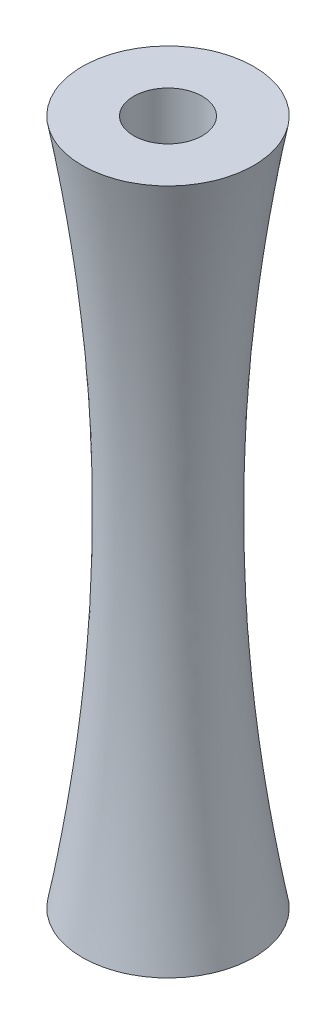
ISO-10303-21;
HEADER;
FILE_DESCRIPTION(('STEP AP214'),'2;1');
FILE_NAME('part.step','',(''),(''),'','','');
FILE_SCHEMA(('AUTOMOTIVE_DESIGN { 1 0 10303 214 1 1 1 1 }'));
ENDSEC;
DATA;
#1=APPLICATION_CONTEXT('core data for automotive mechanical design processes');
#2=APPLICATION_PROTOCOL_DEFINITION('international standard','automotive_design',2000,#1);
#3=PRODUCT_CONTEXT('',#1,'mechanical');
#4=PRODUCT('Part','Part','',(#3));
#5=PRODUCT_RELATED_PRODUCT_CATEGORY('part','',(#4));
#6=PRODUCT_DEFINITION_FORMATION('','',#4);
#7=PRODUCT_DEFINITION_CONTEXT('part definition',#1,'design');
#8=PRODUCT_DEFINITION('design','',#6,#7);
#9=PRODUCT_DEFINITION_SHAPE('','',#8);
#10=(LENGTH_UNIT() NAMED_UNIT(*) SI_UNIT(.MILLI.,.METRE.));
#11=(NAMED_UNIT(*) PLANE_ANGLE_UNIT() SI_UNIT($,.RADIAN.));
#12=(NAMED_UNIT(*) SI_UNIT($,.STERADIAN.) SOLID_ANGLE_UNIT());
#13=UNCERTAINTY_MEASURE_WITH_UNIT(LENGTH_MEASURE(1.E-05),#10,'distance_accuracy_value','');
#14=(GEOMETRIC_REPRESENTATION_CONTEXT(3) GLOBAL_UNCERTAINTY_ASSIGNED_CONTEXT((#13)) GLOBAL_UNIT_ASSIGNED_CONTEXT((#10,
#11,#12)) REPRESENTATION_CONTEXT('',''));
#15=CARTESIAN_POINT('',(0.,0.,0.));
#16=DIRECTION('',(0.,0.,1.));
#17=DIRECTION('',(1.,0.,0.));
#18=AXIS2_PLACEMENT_3D('',#15,#16,#17);
#19=CARTESIAN_POINT('',(0.,60.,0.));
#20=DIRECTION('',(0.,1.,0.));
#21=DIRECTION('',(0.,0.,1.));
#22=AXIS2_PLACEMENT_3D('',#19,#20,#21);
#23=PLANE('',#22);
#24=CARTESIAN_POINT('',(0.,60.,0.));
#25=DIRECTION('',(0.,1.,0.));
#26=DIRECTION('',(0.,0.,1.));
#27=AXIS2_PLACEMENT_3D('',#24,#25,#26);
#28=CIRCLE('',#27,3.);
#29=CARTESIAN_POINT('',(0.,60.,3.));
#30=VERTEX_POINT('',#29);
#31=EDGE_CURVE('E100',#30,#30,#28,.T.);
#32=ORIENTED_EDGE('',*,*,#31,.F.);
#33=EDGE_LOOP('',(#32));
#34=FACE_BOUND('',#33,.T.);
#35=CARTESIAN_POINT('',(0.,60.,0.));
#36=DIRECTION('',(0.,1.,0.));
#37=DIRECTION('',(0.,0.,1.));
#38=AXIS2_PLACEMENT_3D('',#35,#36,#37);
#39=CIRCLE('',#38,7.5);
#40=CARTESIAN_POINT('',(0.,60.,7.5));
#41=VERTEX_POINT('',#40);
#42=EDGE_CURVE('E11',#41,#41,#39,.T.);
#43=ORIENTED_EDGE('',*,*,#42,.T.);
#44=EDGE_LOOP('',(#43));
#45=FACE_BOUND('',#44,.T.);
#46=ADVANCED_FACE('F87',(#34,#45),#23,.T.);
#47=CARTESIAN_POINT('',(0.,0.,0.));
#48=DIRECTION('',(0.,1.,0.));
#49=DIRECTION('',(0.,0.,1.));
#50=AXIS2_PLACEMENT_3D('',#47,#48,#49);
#51=PLANE('',#50);
#52=CARTESIAN_POINT('',(0.,0.,0.));
#53=DIRECTION('',(0.,-1.,0.));
#54=DIRECTION('',(0.,0.,-1.));
#55=AXIS2_PLACEMENT_3D('',#52,#53,#54);
#56=CIRCLE('',#55,3.);
#57=CARTESIAN_POINT('',(0.,0.,-3.));
#58=VERTEX_POINT('',#57);
#59=EDGE_CURVE('E163',#58,#58,#56,.T.);
#60=ORIENTED_EDGE('',*,*,#59,.F.);
#61=EDGE_LOOP('',(#60));
#62=FACE_BOUND('',#61,.T.);
#63=CARTESIAN_POINT('',(0.,0.,0.));
#64=DIRECTION('',(0.,1.,0.));
#65=DIRECTION('',(0.,0.,1.));
#66=AXIS2_PLACEMENT_3D('',#63,#64,#65);
#67=CIRCLE('',#66,7.5);
#68=CARTESIAN_POINT('',(0.,0.,7.5));
#69=VERTEX_POINT('',#68);
#70=EDGE_CURVE('E95',#69,#69,#67,.T.);
#71=ORIENTED_EDGE('',*,*,#70,.F.);
#72=EDGE_LOOP('',(#71));
#73=FACE_BOUND('',#72,.T.);
#74=ADVANCED_FACE('F119',(#62,#73),#51,.F.);
#75=CARTESIAN_POINT('',(0.,0.,7.5));
#76=CARTESIAN_POINT('',(0.,6.64072632944228,6.25162127107653));
#77=CARTESIAN_POINT('',(0.,19.9017616439387,4.58708576383651));
#78=CARTESIAN_POINT('',(0.,40.0982383560613,4.5870857638365));
#79=CARTESIAN_POINT('',(0.,53.3592736705577,6.25162127107652));
#80=CARTESIAN_POINT('',(0.,60.,7.5));
#81=CARTESIAN_POINT('',(0.981747644821663,0.,7.5));
#82=CARTESIAN_POINT('',(0.818357373551676,6.64072632944228,6.25162127107653));
#83=CARTESIAN_POINT('',(0.600440791098656,19.9017616439387,4.58708576383651));
#84=CARTESIAN_POINT('',(0.600440791098657,40.0982383560613,4.58708576383651));
#85=CARTESIAN_POINT('',(0.818357373551675,53.3592736705577,6.25162127107652));
#86=CARTESIAN_POINT('',(0.981747644821663,60.,7.5));
#87=CARTESIAN_POINT('',(2.94482192138882,0.,7.10994749537243));
#88=CARTESIAN_POINT('',(2.45465110757885,6.64072383996429,5.92649931678231));
#89=CARTESIAN_POINT('',(1.80110525290804,19.9017631268565,4.34853905308531));
#90=CARTESIAN_POINT('',(1.80110525290804,40.0982368731434,4.34853905308531));
#91=CARTESIAN_POINT('',(2.45465110757885,53.3592761600357,5.92649931678231));
#92=CARTESIAN_POINT('',(2.94482192138882,60.,7.10994749537243));
#93=CARTESIAN_POINT('',(5.44166129928465,0.,5.44146013449238));
#94=CARTESIAN_POINT('',(4.53586462026115,6.64072384623036,4.53572733587199));
#95=CARTESIAN_POINT('',(3.32810591228955,19.901763123124,3.32806116946585));
#96=CARTESIAN_POINT('',(3.32810591228955,40.0982368768761,3.32806116946585));
#97=CARTESIAN_POINT('',(4.53586462026114,53.3592761537697,4.53572733587198));
#98=CARTESIAN_POINT('',(5.44166129928465,60.0000000000001,5.44146013449238));
#99=CARTESIAN_POINT('',(7.10969915199535,0.,2.94496975546454));
#100=CARTESIAN_POINT('',(5.926286241772,6.64072493633441,2.45480405711622));
#101=CARTESIAN_POINT('',(4.34837515630249,19.9017624737771,1.80123771160252));
#102=CARTESIAN_POINT('',(4.34837515630248,40.0982375262228,1.80123771160252));
#103=CARTESIAN_POINT('',(5.926286241772,53.3592750636655,2.45480405711622));
#104=CARTESIAN_POINT('',(7.10969915199535,59.9999999999999,2.94496975546454));
#105=CARTESIAN_POINT('',(7.69554063634128,0.,-2.67619228474895E-05));
#106=CARTESIAN_POINT('',(6.41461225339653,6.64072424410573,-2.73075102060959E-05));
#107=CARTESIAN_POINT('',(4.70667553411878,19.9017628861199,-2.80338664006645E-05));
#108=CARTESIAN_POINT('',(4.70667553411877,40.0982371138801,-2.80338664001364E-05));
#109=CARTESIAN_POINT('',(6.41461225339653,53.3592757558943,-2.73075102069825E-05));
#110=CARTESIAN_POINT('',(7.69554063634127,60.,-2.67619228474895E-05));
#111=CARTESIAN_POINT('',(7.10971578776931,0.,-2.94490446267548));
#112=CARTESIAN_POINT('',(5.92630181071778,6.64072493870547,-2.45473821202761));
#113=CARTESIAN_POINT('',(4.34838747738739,19.9017624723648,-1.80117113452925));
#114=CARTESIAN_POINT('',(4.34838747738739,40.0982375276353,-1.80117113452925));
#115=CARTESIAN_POINT('',(5.92630181071778,53.3592750612946,-2.4547382120276));
#116=CARTESIAN_POINT('',(7.10971578776931,60.0000000000001,-2.94490446267548));
#117=CARTESIAN_POINT('',(5.44161746602329,0.,-5.44157367593528));
#118=CARTESIAN_POINT('',(4.53582471749693,6.64072371496753,-4.53583514124079));
#119=CARTESIAN_POINT('',(3.32807853314484,19.9017632013138,-3.32816130333773));
#120=CARTESIAN_POINT('',(3.32807853314484,40.0982367986861,-3.32816130333773));
#121=CARTESIAN_POINT('',(4.53582471749693,53.3592762850324,-4.53583514124079));
#122=CARTESIAN_POINT('',(5.44161746602329,59.9999999999999,-5.44157367593528));
#123=CARTESIAN_POINT('',(2.94491624384262,0.,-7.10972919973185));
#124=CARTESIAN_POINT('',(2.45473844623964,6.64072442991887,-5.92629913830792));
#125=CARTESIAN_POINT('',(1.80115598155029,19.9017627754358,-4.34836312779551));
#126=CARTESIAN_POINT('',(1.80115598155029,40.0982372245642,-4.34836312779551));
#127=CARTESIAN_POINT('',(2.45473844623964,53.3592755700813,-5.92629913830792));
#128=CARTESIAN_POINT('',(2.94491624384262,60.0000000000002,-7.10972919973185));
#129=CARTESIAN_POINT('',(0.,0.,-7.69551250799886));
#130=CARTESIAN_POINT('',(0.,6.64072592199922,-6.41462674512618));
#131=CARTESIAN_POINT('',(0.,19.901761886642,-4.7067476625407));
#132=CARTESIAN_POINT('',(0.,40.0982381133578,-4.7067476625407));
#133=CARTESIAN_POINT('',(0.,53.3592740780006,-6.41462674512618));
#134=CARTESIAN_POINT('',(0.,59.9999999999999,-7.69551250799886));
#135=CARTESIAN_POINT('',(-2.94491624384264,0.,-7.10972919973187));
#136=CARTESIAN_POINT('',(-2.45473844623965,6.64072442991889,-5.92629913830794));
#137=CARTESIAN_POINT('',(-1.80115598155027,19.9017627754359,-4.34836312779553));
#138=CARTESIAN_POINT('',(-1.80115598155028,40.0982372245645,-4.34836312779554));
#139=CARTESIAN_POINT('',(-2.45473844623965,53.3592755700813,-5.92629913830793));
#140=CARTESIAN_POINT('',(-2.94491624384264,60.0000000000001,-7.10972919973187));
#141=CARTESIAN_POINT('',(-5.4416174660233,0.,-5.44157367593527));
#142=CARTESIAN_POINT('',(-4.53582471749692,6.6407237149675,-4.53583514124079));
#143=CARTESIAN_POINT('',(-3.32807853314482,19.9017632013138,-3.32816130333774));
#144=CARTESIAN_POINT('',(-3.32807853314481,40.0982367986859,-3.32816130333774));
#145=CARTESIAN_POINT('',(-4.53582471749693,53.3592762850324,-4.53583514124079));
#146=CARTESIAN_POINT('',(-5.4416174660233,59.9999999999999,-5.44157367593527));
#147=CARTESIAN_POINT('',(-7.1097157877693,0.,-2.94490446267547));
#148=CARTESIAN_POINT('',(-5.92630181071777,6.64072493870549,-2.45473821202761));
#149=CARTESIAN_POINT('',(-4.34838747738738,19.9017624723648,-1.80117113452928));
#150=CARTESIAN_POINT('',(-4.34838747738738,40.0982375276355,-1.80117113452928));
#151=CARTESIAN_POINT('',(-5.92630181071776,53.3592750612946,-2.45473821202761));
#152=CARTESIAN_POINT('',(-7.10971578776929,60.0000000000001,-2.94490446267547));
#153=CARTESIAN_POINT('',(-7.69554063634129,0.,-2.67619228362138E-05));
#154=CARTESIAN_POINT('',(-6.41461225339654,6.6407242441057,-2.73075102087398E-05));
#155=CARTESIAN_POINT('',(-4.70667553411878,19.9017628861198,-2.80338664210188E-05));
#156=CARTESIAN_POINT('',(-4.70667553411878,40.0982371138799,-2.80338664209986E-05));
#157=CARTESIAN_POINT('',(-6.41461225339654,53.3592757558941,-2.73075102087736E-05));
#158=CARTESIAN_POINT('',(-7.69554063634128,59.9999999999998,-2.67619228362138E-05));
#159=CARTESIAN_POINT('',(-7.10969915199534,0.,2.94496975546455));
#160=CARTESIAN_POINT('',(-5.92628624177201,6.64072493633445,2.45480405711621));
#161=CARTESIAN_POINT('',(-4.34837515630249,19.9017624737772,1.8012377116025));
#162=CARTESIAN_POINT('',(-4.3483751563025,40.098237526223,1.80123771160251));
#163=CARTESIAN_POINT('',(-5.926286241772,53.3592750636658,2.45480405711621));
#164=CARTESIAN_POINT('',(-7.10969915199534,60.0000000000001,2.94496975546455));
#165=CARTESIAN_POINT('',(-5.44166129928467,0.,5.44146013449239));
#166=CARTESIAN_POINT('',(-4.53586462026115,6.64072384623035,4.53572733587199));
#167=CARTESIAN_POINT('',(-3.32810591228956,19.901763123124,3.32806116946584));
#168=CARTESIAN_POINT('',(-3.32810591228955,40.0982368768761,3.32806116946584));
#169=CARTESIAN_POINT('',(-4.53586462026115,53.3592761537696,4.53572733587199));
#170=CARTESIAN_POINT('',(-5.44166129928467,59.9999999999999,5.44146013449239));
#171=CARTESIAN_POINT('',(-2.94482192138881,0.,7.10994749537242));
#172=CARTESIAN_POINT('',(-2.45465110757886,6.64072383996429,5.9264993167823));
#173=CARTESIAN_POINT('',(-1.80110525290805,19.9017631268565,4.34853905308532));
#174=CARTESIAN_POINT('',(-1.80110525290805,40.0982368731434,4.34853905308532));
#175=CARTESIAN_POINT('',(-2.45465110757885,53.3592761600358,5.9264993167823));
#176=CARTESIAN_POINT('',(-2.94482192138881,60.,7.10994749537242));
#177=CARTESIAN_POINT('',(-0.981747644821663,0.,7.5));
#178=CARTESIAN_POINT('',(-0.818357373551675,6.64072632944228,6.25162127107653));
#179=CARTESIAN_POINT('',(-0.600440791098657,19.9017616439387,4.58708576383651));
#180=CARTESIAN_POINT('',(-0.600440791098656,40.0982383560612,4.5870857638365));
#181=CARTESIAN_POINT('',(-0.818357373551675,53.3592736705577,6.25162127107652));
#182=CARTESIAN_POINT('',(-0.981747644821663,60.,7.5));
#183=CARTESIAN_POINT('',(0.,0.,7.5));
#184=CARTESIAN_POINT('',(0.,6.64072632944228,6.25162127107653));
#185=CARTESIAN_POINT('',(0.,19.9017616439387,4.58708576383651));
#186=CARTESIAN_POINT('',(0.,40.0982383560613,4.5870857638365));
#187=CARTESIAN_POINT('',(0.,53.3592736705577,6.25162127107652));
#188=CARTESIAN_POINT('',(0.,60.,7.5));
#189=B_SPLINE_SURFACE_WITH_KNOTS('',3,3,((#75,#76,#77,#78,#79,#80),(#81,#82,#83,#84,#85,#86),
(#87,#88,#89,#90,#91,#92),(#93,#94,#95,#96,#97,#98),(#99,#100,#101,#102,#103,#104),(#105,#106,
#107,#108,#109,#110),(#111,#112,#113,#114,#115,#116),(#117,#118,#119,#120,#121,#122),(#123,#124,
#125,#126,#127,#128),(#129,#130,#131,#132,#133,#134),(#135,#136,#137,#138,#139,#140),(#141,#142,
#143,#144,#145,#146),(#147,#148,#149,#150,#151,#152),(#153,#154,#155,#156,#157,#158),(#159,#160,
#161,#162,#163,#164),(#165,#166,#167,#168,#169,#170),(#171,#172,#173,#174,#175,#176),(#177,#178,
#179,#180,#181,#182),(#183,#184,#185,#186,#187,#188)),.UNSPECIFIED.,.T.,.F.,.F.,(4,1,1,1,1,1,1,
1,1,1,1,1,1,1,1,1,4),(4,1,1,4),(0.,0.0625,0.125,0.1875,0.25,0.3125,0.375,0.4375,0.5,0.5625,
0.625,0.6875,0.75,0.8125,0.875,0.9375,1.),(0.,0.334193561293937,0.665806438706063,1.),.UNSPECIFIED.);
#190=CARTESIAN_POINT('',(0.,0.,7.5));
#191=CARTESIAN_POINT('',(0.,0.0776125402742504,7.48540975171107));
#192=CARTESIAN_POINT('',(0.,0.155235393256961,7.47087436076974));
#193=CARTESIAN_POINT('',(0.,0.310485436550854,7.44191644167547));
#194=CARTESIAN_POINT('',(0.,0.388112622599399,7.4274938906695));
#195=CARTESIAN_POINT('',(0.,0.543371432193753,7.39876167207162));
#196=CARTESIAN_POINT('',(0.,0.621003051571173,7.38445198195527));
#197=CARTESIAN_POINT('',(0.,0.776270827807163,7.35594550543869));
#198=CARTESIAN_POINT('',(0.,0.853906980590911,7.34174869684396));
#199=CARTESIAN_POINT('',(0.,1.00918392367389,7.31346800375774));
#200=CARTESIAN_POINT('',(0.,1.08682470999112,7.29938409740292));
#201=CARTESIAN_POINT('',(0.,1.24211102016281,7.2713292291593));
#202=CARTESIAN_POINT('',(0.,1.31975654012736,7.25735824573959));
#203=CARTESIAN_POINT('',(0.,1.47505241761974,7.22952924373386));
#204=CARTESIAN_POINT('',(0.,1.55270277134901,7.21567120395062));
#205=CARTESIAN_POINT('',(0.,1.70800841639666,7.18806810958264));
#206=CARTESIAN_POINT('',(0.,1.78566370400708,7.17432303413557));
#207=CARTESIAN_POINT('',(0.,1.94097931684388,7.14694588880395));
#208=CARTESIAN_POINT('',(0.,2.01863963845214,7.1333137983932));
#209=CARTESIAN_POINT('',(0.,2.17396541931215,7.10616264349688));
#210=CARTESIAN_POINT('',(0.,2.25163087503485,7.09264355882246));
#211=CARTESIAN_POINT('',(0.,2.40696702415208,7.06571843576029));
#212=CARTESIAN_POINT('',(0.,2.48463771410585,7.05231237752224));
#213=CARTESIAN_POINT('',(0.,2.63998443171431,7.0256133276931));
#214=CARTESIAN_POINT('',(0.,2.71766045601575,7.01232031659145));
#215=CARTESIAN_POINT('',(0.,2.87301794234945,6.9858473813942));
#216=CARTESIAN_POINT('',(0.,2.95069940111518,6.97266743812897));
#217=CARTESIAN_POINT('',(0.,3.10606785640812,6.94642065896248));
#218=CARTESIAN_POINT('',(0.,3.18375484975473,6.93335380423368));
#219=CARTESIAN_POINT('',(0.,3.3391344742409,6.90733322249681));
#220=CARTESIAN_POINT('',(0.,3.416827102285,6.89437947700444));
#221=CARTESIAN_POINT('',(0.,3.5722180961984,6.86858513409604));
#222=CARTESIAN_POINT('',(0.,3.64991645905656,6.85574451854012));
#223=CARTESIAN_POINT('',(0.,3.80531902263119,6.83017645585905));
#224=CARTESIAN_POINT('',(0.,3.88302322041999,6.81744899093956));
#225=CARTESIAN_POINT('',(0.,4.03843755388983,6.79210724988467));
#226=CARTESIAN_POINT('',(0.,4.11614768672586,6.7794929563016));
#227=CARTESIAN_POINT('',(0.,4.27157399032488,6.75437757827174));
#228=CARTESIAN_POINT('',(0.,4.3492901583247,6.74187647672507));
#229=CARTESIAN_POINT('',(0.,4.50472863228689,6.71698750311907));
#230=CARTESIAN_POINT('',(0.,4.58245093556707,6.70459961430877));
#231=CARTESIAN_POINT('',(0.,4.7379017801264,6.67993708652549));
#232=CARTESIAN_POINT('',(0.,4.81563031880349,6.66766243115153));
#233=CARTESIAN_POINT('',(0.,4.97109373419392,6.6432263905898));
#234=CARTESIAN_POINT('',(0.,5.04882860838449,6.63106498935213));
#235=CARTESIAN_POINT('',(0.,5.20430479483998,6.60685547741078));
#236=CARTESIAN_POINT('',(0.,5.28204610466057,6.59480735100936));
#237=CARTESIAN_POINT('',(0.,5.43753526241508,6.57082440908723));
#238=CARTESIAN_POINT('',(0.,5.51528310798223,6.558889578222));
#239=CARTESIAN_POINT('',(0.,5.67078543726973,6.53513324771792));
#240=CARTESIAN_POINT('',(0.,5.74853991869998,6.5233117330888));
#241=CARTESIAN_POINT('',(0.,5.9040556197544,6.49978205540159));
#242=CARTESIAN_POINT('',(0.,5.98181683716428,6.48807387770853));
#243=CARTESIAN_POINT('',(0.,6.13734611021958,6.46477089423701));
#244=CARTESIAN_POINT('',(0.,6.21511416372562,6.45317607417993));
#245=CARTESIAN_POINT('',(0.,6.37065720901573,6.43009982632292));
#246=CARTESIAN_POINT('',(0.,6.44843219873445,6.41861838460172));
#247=CARTESIAN_POINT('',(0.,6.60398921649332,6.39576891375804));
#248=CARTESIAN_POINT('',(0.,6.68177124254123,6.38440087107262));
#249=CARTESIAN_POINT('',(0.,6.83734243300279,6.36177821864109));
#250=CARTESIAN_POINT('',(0.,6.9151315954964,6.35052359569135));
#251=CARTESIAN_POINT('',(0.,7.07071715889458,6.32812780307076));
#252=CARTESIAN_POINT('',(0.,7.14851355795041,6.31698662055661));
#253=CARTESIAN_POINT('',(0.,7.30411369451913,6.29481772914577));
#254=CARTESIAN_POINT('',(0.,7.38191743025366,6.28379000776707));
#255=CARTESIAN_POINT('',(0.,7.53753234022685,6.26184805896479));
#256=CARTESIAN_POINT('',(0.,7.61534351275659,6.25093381942142));
#257=CARTESIAN_POINT('',(0.,7.77097339636817,6.22921885462649));
#258=CARTESIAN_POINT('',(0.,7.8487921058096,6.21841811761831));
#259=CARTESIAN_POINT('',(0.,8.00443716329347,6.19693017822953));
#260=CARTESIAN_POINT('',(0.,8.08226350976309,6.1862429644564));
#261=CARTESIAN_POINT('',(0.,8.23792394135317,6.16498209187255));
#262=CARTESIAN_POINT('',(0.,8.31575802496745,6.15440842203433));
#263=CARTESIAN_POINT('',(0.,8.47143403089765,6.13337465765421));
#264=CARTESIAN_POINT('',(0.,8.54927595177306,6.12291455245072));
#265=CARTESIAN_POINT('',(0.,8.70496773227728,6.1021079376731));
#266=CARTESIAN_POINT('',(0.,8.7828175905303,6.09176141780419));
#267=CARTESIAN_POINT('',(0.,8.93852534584244,6.07118199402786));
#268=CARTESIAN_POINT('',(0.,9.01638324158953,6.06094908019335));
#269=CARTESIAN_POINT('',(0.,9.17210717194349,6.04059688881707));
#270=CARTESIAN_POINT('',(0.,9.24997320530111,6.03047760171678));
#271=CARTESIAN_POINT('',(0.,9.40571351093078,6.01035268413934));
#272=CARTESIAN_POINT('',(0.,9.48358778201539,6.00034704447306));
#273=CARTESIAN_POINT('',(0.,9.63934466315466,5.98044944209322));
#274=CARTESIAN_POINT('',(0.,9.71722727208271,5.97055747056077));
#275=CARTESIAN_POINT('',(0.,9.87300092896546,5.95088722477729));
#276=CARTESIAN_POINT('',(0.,9.9508919758534,5.94110894207845));
#277=CARTESIAN_POINT('',(0.,10.1066826087135,5.9216660942901));
#278=CARTESIAN_POINT('',(0.,10.1845821936778,5.91200152112465));
#279=CARTESIAN_POINT('',(0.,10.3403900027491,5.89278611273018));
#280=CARTESIAN_POINT('',(0.,10.4182982259062,5.88323526979789));
#281=CARTESIAN_POINT('',(0.,10.5741234114227,5.86424734219605));
#282=CARTESIAN_POINT('',(0.,10.6520403728889,5.8548102501967));
#283=CARTESIAN_POINT('',(0.,10.8078831350844,5.83604984478624));
#284=CARTESIAN_POINT('',(0.,10.8858089349763,5.82672652441957));
#285=CARTESIAN_POINT('',(0.,11.0416694740846,5.80819368259924));
#286=CARTESIAN_POINT('',(0.,11.1196042125185,5.79898415456501));
#287=CARTESIAN_POINT('',(0.,11.2754827287736,5.78067891773355));
#288=CARTESIAN_POINT('',(0.,11.353426505866,5.77158320273147));
#289=CARTESIAN_POINT('',(0.,11.5093231995017,5.75350561228762));
#290=CARTESIAN_POINT('',(0.,11.587276115369,5.74452373101745));
#291=CARTESIAN_POINT('',(0.,11.7431911866191,5.72667382835993));
#292=CARTESIAN_POINT('',(0.,11.8211533413777,5.71780580152137));
#293=CARTESIAN_POINT('',(0.,11.9770869904761,5.70018362804892));
#294=CARTESIAN_POINT('',(0.,12.0550584842425,5.6914294763417));
#295=CARTESIAN_POINT('',(0.,12.211010911423,5.67403507345303));
#296=CARTESIAN_POINT('',(0.,12.2889918443135,5.66539481757684));
#297=CARTESIAN_POINT('',(0.,12.4449632498101,5.64822822667068));
#298=CARTESIAN_POINT('',(0.,12.5229537219411,5.63970188732522));
#299=CARTESIAN_POINT('',(0.,12.6789443059875,5.62276314980029));
#300=CARTESIAN_POINT('',(0.,12.7569444174755,5.61435074768523));
#301=CARTESIAN_POINT('',(0.,12.9129543803056,5.59763990494023));
#302=CARTESIAN_POINT('',(0.,12.9909642312669,5.58934146075526));
#303=CARTESIAN_POINT('',(0.,13.1469937731145,5.57285855418891));
#304=CARTESIAN_POINT('',(0.,13.2250134636655,5.56467408863368));
#305=CARTESIAN_POINT('',(0.,13.3810627847645,5.54841915964468));
#306=CARTESIAN_POINT('',(0.,13.4590924150217,5.54034869341885));
#307=CARTESIAN_POINT('',(0.,13.6151617156059,5.5243217834059));
#308=CARTESIAN_POINT('',(0.,13.6932013856855,5.51636533720913));
#309=CARTESIAN_POINT('',(0.,13.8492908659887,5.50056648757092));
#310=CARTESIAN_POINT('',(0.,13.9273406760072,5.49272408210283));
#311=CARTESIAN_POINT('',(0.,14.0834505362634,5.47715333423805));
#312=CARTESIAN_POINT('',(0.,14.1615105863371,5.46942499019828));
#313=CARTESIAN_POINT('',(0.,14.31764102678,5.45408238550562));
#314=CARTESIAN_POINT('',(0.,14.3957114170253,5.44646812359378));
#315=CARTESIAN_POINT('',(0.,14.5518626378887,5.43135370347193));
#316=CARTESIAN_POINT('',(0.,14.629943468422,5.42385354438763));
#317=CARTESIAN_POINT('',(0.,14.7861156699398,5.40896735023526));
#318=CARTESIAN_POINT('',(0.,14.8642070408775,5.40158131467811));
#319=CARTESIAN_POINT('',(0.,15.0204004232834,5.38692338789388));
#320=CARTESIAN_POINT('',(0.,15.0985024347418,5.37965149656346));
#321=CARTESIAN_POINT('',(0.,15.2547171982697,5.36522187854605));
#322=CARTESIAN_POINT('',(0.,15.3328299503653,5.35806415214195));
#323=CARTESIAN_POINT('',(0.,15.4890662952489,5.34386288429003));
#324=CARTESIAN_POINT('',(0.,15.5671898880979,5.33681934351181));
#325=CARTESIAN_POINT('',(0.,15.7234480145713,5.32284646722404));
#326=CARTESIAN_POINT('',(0.,15.8015825482901,5.31591713277127));
#327=CARTESIAN_POINT('',(0.,15.9578626565868,5.30217268944629));
#328=CARTESIAN_POINT('',(0.,16.0360082312918,5.29535758201851));
#329=CARTESIAN_POINT('',(0.,16.1923105216457,5.28184161305499));
#330=CARTESIAN_POINT('',(0.,16.2704672374532,5.27514075335176));
#331=CARTESIAN_POINT('',(0.,16.4267919100982,5.26185330014833));
#332=CARTESIAN_POINT('',(0.,16.5049598671246,5.25526670886917));
#333=CARTESIAN_POINT('',(0.,16.6613071222945,5.24220781282447));
#334=CARTESIAN_POINT('',(0.,16.739486420656,5.23573551066891));
#335=CARTESIAN_POINT('',(0.,16.8958564585845,5.2229052131816));
#336=CARTESIAN_POINT('',(0.,16.9740471983976,5.21654722084914));
#337=CARTESIAN_POINT('',(0.,17.1304402193186,5.20394556331784));
#338=CARTESIAN_POINT('',(0.,17.2086425006996,5.19770190150799));
#339=CARTESIAN_POINT('',(0.,17.3650587048468,5.18532892533132));
#340=CARTESIAN_POINT('',(0.,17.4432726279121,5.17919961474358));
#341=CARTESIAN_POINT('',(0.,17.5997122155194,5.16705536132017));
#342=CARTESIAN_POINT('',(0.,17.6779378803851,5.16104042265402));
#343=CARTESIAN_POINT('',(0.,17.8344010516863,5.14912493338248));
#344=CARTESIAN_POINT('',(0.,17.912638558469,5.14322438733737));
#345=CARTESIAN_POINT('',(0.,18.0691255136978,5.13153770361639));
#346=CARTESIAN_POINT('',(0.,18.1473749625137,5.12575157089189));
#347=CARTESIAN_POINT('',(0.,18.3038859019039,5.11429373411977));
#348=CARTESIAN_POINT('',(0.,18.3821473928694,5.10862203541491));
#349=CARTESIAN_POINT('',(0.,18.5386825166549,5.09739308699141));
#350=CARTESIAN_POINT('',(0.,18.6169561498863,5.09183584300721));
#351=CARTESIAN_POINT('',(0.,18.7735156583006,5.08083582432665));
#352=CARTESIAN_POINT('',(0.,18.8518015339139,5.0753930557567));
#353=CARTESIAN_POINT('',(0.,19.0083856271918,5.06462200823361));
#354=CARTESIAN_POINT('',(0.,19.0866838453048,5.05929373579909));
#355=CARTESIAN_POINT('',(0.,19.2432927236764,5.04875170077263));
#356=CARTESIAN_POINT('',(0.,19.3216033844002,5.0435379450918));
#357=CARTESIAN_POINT('',(0.,19.478237248113,5.0332249641823));
#358=CARTESIAN_POINT('',(0.,19.5565604515829,5.02812574625746));
#359=CARTESIAN_POINT('',(0.,19.7132195008194,5.01804186003594));
#360=CARTESIAN_POINT('',(0.,19.7915553470814,5.01305719943593));
#361=CARTESIAN_POINT('',(0.,19.9482397763526,5.00320245276174));
#362=CARTESIAN_POINT('',(0.,20.0265883598701,4.99833237476895));
#363=CARTESIAN_POINT('',(0.,20.1832981790801,4.98870680508653));
#364=CARTESIAN_POINT('',(0.,20.2616594152766,4.98395132160103));
#365=CARTESIAN_POINT('',(0.,20.4183942493215,4.97455493556707));
#366=CARTESIAN_POINT('',(0.,20.496767847651,4.96991404104381));
#367=CARTESIAN_POINT('',(0.,20.6535271045492,4.96074683442519));
#368=CARTESIAN_POINT('',(0.,20.7319127635758,4.95622053015999));
#369=CARTESIAN_POINT('',(0.,20.8886958403522,4.94728250390532));
#370=CARTESIAN_POINT('',(0.,20.9670932585372,4.9428707895508));
#371=CARTESIAN_POINT('',(0.,21.1238995521413,4.9341619434057));
#372=CARTESIAN_POINT('',(0.,21.2023084279735,4.92986481905483));
#373=CARTESIAN_POINT('',(0.,21.359137335375,4.92138515308726));
#374=CARTESIAN_POINT('',(0.,21.4375573673359,4.91720261871501));
#375=CARTESIAN_POINT('',(0.,21.594408285499,4.9089521329066));
#376=CARTESIAN_POINT('',(0.,21.672839172072,4.90488418851956));
#377=CARTESIAN_POINT('',(0.,21.8297114979625,4.89686288287506));
#378=CARTESIAN_POINT('',(0.,21.9081529376305,4.89290952847135));
#379=CARTESIAN_POINT('',(0.,22.0650460682138,4.88511740298932));
#380=CARTESIAN_POINT('',(0.,22.1434977594598,4.88127863856934));
#381=CARTESIAN_POINT('',(0.,22.3004110917013,4.87371569324999));
#382=CARTESIAN_POINT('',(0.,22.3788727330083,4.86999151881353));
#383=CARTESIAN_POINT('',(0.,22.5358056638734,4.86265775365666));
#384=CARTESIAN_POINT('',(0.,22.6142769537244,4.85904816920368));
#385=CARTESIAN_POINT('',(0.,22.7712288801787,4.85194358420917));
#386=CARTESIAN_POINT('',(0.,22.8497095170567,4.84844858973958));
#387=CARTESIAN_POINT('',(0.,23.0066798360654,4.84157318490733));
#388=CARTESIAN_POINT('',(0.,23.0851695184535,4.83819278042106));
#389=CARTESIAN_POINT('',(0.,23.2421576269822,4.83154655575095));
#390=CARTESIAN_POINT('',(0.,23.3206560533633,4.82828074124792));
#391=CARTESIAN_POINT('',(0.,23.4776613483773,4.82186369673984));
#392=CARTESIAN_POINT('',(0.,23.5561682172344,4.81871247222));
#393=CARTESIAN_POINT('',(0.,23.7131900956993,4.81252460787384));
#394=CARTESIAN_POINT('',(0.,23.7917051055154,4.80948797333711));
#395=CARTESIAN_POINT('',(0.,23.9487429643965,4.80352928915278));
#396=CARTESIAN_POINT('',(0.,24.0272658136546,4.80060724459909));
#397=CARTESIAN_POINT('',(0.,24.1843190499173,4.79487774057649));
#398=CARTESIAN_POINT('',(0.,24.2628494371005,4.79207028600579));
#399=CARTESIAN_POINT('',(0.,24.4199174477103,4.78656996214483));
#400=CARTESIAN_POINT('',(0.,24.4984550713016,4.78387709755706));
#401=CARTESIAN_POINT('',(0.,24.6555372532239,4.77860595385764));
#402=CARTESIAN_POINT('',(0.,24.7340818117062,4.77602767925273));
#403=CARTESIAN_POINT('',(0.,24.8911775619064,4.77098571571477));
#404=CARTESIAN_POINT('',(0.,24.9697287537627,4.76852203109269));
#405=CARTESIAN_POINT('',(0.,25.1268374692063,4.7637092477161));
#406=CARTESIAN_POINT('',(0.,25.2053949929196,4.76136015307678));
#407=CARTESIAN_POINT('',(0.,25.362516070572,4.7567765498615));
#408=CARTESIAN_POINT('',(0.,25.4410796246254,4.75454204520489));
#409=CARTESIAN_POINT('',(0.,25.598212461452,4.75018762215083));
#410=CARTESIAN_POINT('',(0.,25.6767817443284,4.7480677074769));
#411=CARTESIAN_POINT('',(0.,25.8339257372947,4.74394246458399));
#412=CARTESIAN_POINT('',(0.,25.9125004474771,4.74193713989268));
#413=CARTESIAN_POINT('',(0.,26.0696549935484,4.73804107716086));
#414=CARTESIAN_POINT('',(0.,26.1482348295199,4.73615034245214));
#415=CARTESIAN_POINT('',(0.,26.3053993256617,4.73248345988134));
#416=CARTESIAN_POINT('',(0.,26.3839839859052,4.73070731515516));
#417=CARTESIAN_POINT('',(0.,26.541157829083,4.72726961274532));
#418=CARTESIAN_POINT('',(0.,26.6197470120815,4.72560805800165));
#419=CARTESIAN_POINT('',(0.,26.7769295992606,4.72239953575272));
#420=CARTESIAN_POINT('',(0.,26.8555230034971,4.72085257099151));
#421=CARTESIAN_POINT('',(0.,27.012713731643,4.71787322890344));
#422=CARTESIAN_POINT('',(0.,27.0913110556006,4.71644085412468));
#423=CARTESIAN_POINT('',(0.,27.2485093216786,4.71369069219741));
#424=CARTESIAN_POINT('',(0.,27.3271102638403,4.71237290740106));
#425=CARTESIAN_POINT('',(0.,27.4843154648159,4.70985192563456));
#426=CARTESIAN_POINT('',(0.,27.5629197236646,4.70864873082059));
#427=CARTESIAN_POINT('',(0.,27.7201312565033,4.70635692921481));
#428=CARTESIAN_POINT('',(0.,27.798738530522,4.7052683243832));
#429=CARTESIAN_POINT('',(0.,27.9559557921892,4.7032057029381));
#430=CARTESIAN_POINT('',(0.,28.0345657798608,4.70223168808882));
#431=CARTESIAN_POINT('',(0.,28.1917881673219,4.70039824680438));
#432=CARTESIAN_POINT('',(0.,28.2704005671296,4.69953882193741));
#433=CARTESIAN_POINT('',(0.,28.42762747735,4.69793456081359));
#434=CARTESIAN_POINT('',(0.,28.5062419877768,4.69718972592893));
#435=CARTESIAN_POINT('',(0.,28.6634728177219,4.69581464496569));
#436=CARTESIAN_POINT('',(0.,28.7420891372507,4.69518440006331));
#437=CARTESIAN_POINT('',(0.,28.899323283886,4.69403849926065));
#438=CARTESIAN_POINT('',(0.,28.9779411109997,4.69352284434054));
#439=CARTESIAN_POINT('',(0.,29.1351779712906,4.69260612369844));
#440=CARTESIAN_POINT('',(0.,29.2137970044724,4.69220505876058));
#441=CARTESIAN_POINT('',(0.,29.3710359753843,4.69151751827902));
#442=CARTESIAN_POINT('',(0.,29.4496559131171,4.69123104332341));
#443=CARTESIAN_POINT('',(0.,29.6068963916155,4.69077268300238));
#444=CARTESIAN_POINT('',(0.,29.6855169323822,4.69060079802902));
#445=CARTESIAN_POINT('',(0.,29.8427583154325,4.6903716178685));
#446=CARTESIAN_POINT('',(0.,29.9213791577162,4.69031432287738));
#447=CARTESIAN_POINT('',(0.,30.0786208422838,4.69031432287738));
#448=CARTESIAN_POINT('',(0.,30.1572416845675,4.6903716178685));
#449=CARTESIAN_POINT('',(0.,30.3144830676178,4.69060079802902));
#450=CARTESIAN_POINT('',(0.,30.3931036083845,4.69077268300238));
#451=CARTESIAN_POINT('',(0.,30.5503440868829,4.69123104332341));
#452=CARTESIAN_POINT('',(0.,30.6289640246157,4.69151751827902));
#453=CARTESIAN_POINT('',(0.,30.7862029955276,4.69220505876058));
#454=CARTESIAN_POINT('',(0.,30.8648220287094,4.69260612369844));
#455=CARTESIAN_POINT('',(0.,31.0220588890003,4.69352284434054));
#456=CARTESIAN_POINT('',(0.,31.100676716114,4.69403849926065));
#457=CARTESIAN_POINT('',(0.,31.2579108627493,4.69518440006331));
#458=CARTESIAN_POINT('',(0.,31.3365271822781,4.69581464496569));
#459=CARTESIAN_POINT('',(0.,31.4937580122232,4.69718972592893));
#460=CARTESIAN_POINT('',(0.,31.5723725226499,4.69793456081359));
#461=CARTESIAN_POINT('',(0.,31.7295994328704,4.69953882193741));
#462=CARTESIAN_POINT('',(0.,31.8082118326781,4.70039824680437));
#463=CARTESIAN_POINT('',(0.,31.9654342201392,4.70223168808882));
#464=CARTESIAN_POINT('',(0.,32.0440442078108,4.7032057029381));
#465=CARTESIAN_POINT('',(0.,32.201261469478,4.7052683243832));
#466=CARTESIAN_POINT('',(0.,32.2798687434967,4.70635692921481));
#467=CARTESIAN_POINT('',(0.,32.4370802763354,4.70864873082059));
#468=CARTESIAN_POINT('',(0.,32.5156845351841,4.70985192563456));
#469=CARTESIAN_POINT('',(0.,32.6728897361597,4.71237290740106));
#470=CARTESIAN_POINT('',(0.,32.7514906783213,4.71369069219741));
#471=CARTESIAN_POINT('',(0.,32.9086889443994,4.71644085412468));
#472=CARTESIAN_POINT('',(0.,32.987286268357,4.71787322890344));
#473=CARTESIAN_POINT('',(0.,33.1444769965029,4.72085257099151));
#474=CARTESIAN_POINT('',(0.,33.2230704007394,4.72239953575272));
#475=CARTESIAN_POINT('',(0.,33.3802529879185,4.72560805800165));
#476=CARTESIAN_POINT('',(0.,33.458842170917,4.72726961274532));
#477=CARTESIAN_POINT('',(0.,33.6160160140948,4.73070731515516));
#478=CARTESIAN_POINT('',(0.,33.6946006743383,4.73248345988134));
#479=CARTESIAN_POINT('',(0.,33.8517651704801,4.73615034245214));
#480=CARTESIAN_POINT('',(0.,33.9303450064516,4.73804107716086));
#481=CARTESIAN_POINT('',(0.,34.0874995525229,4.74193713989268));
#482=CARTESIAN_POINT('',(0.,34.1660742627053,4.74394246458399));
#483=CARTESIAN_POINT('',(0.,34.3232182556716,4.7480677074769));
#484=CARTESIAN_POINT('',(0.,34.401787538548,4.75018762215083));
#485=CARTESIAN_POINT('',(0.,34.5589203753746,4.75454204520489));
#486=CARTESIAN_POINT('',(0.,34.637483929428,4.7567765498615));
#487=CARTESIAN_POINT('',(0.,34.7946050070804,4.76136015307678));
#488=CARTESIAN_POINT('',(0.,34.8731625307937,4.7637092477161));
#489=CARTESIAN_POINT('',(0.,35.0302712462373,4.76852203109269));
#490=CARTESIAN_POINT('',(0.,35.1088224380936,4.77098571571477));
#491=CARTESIAN_POINT('',(0.,35.2659181882938,4.77602767925273));
#492=CARTESIAN_POINT('',(0.,35.3444627467761,4.77860595385763));
#493=CARTESIAN_POINT('',(0.,35.5015449286984,4.78387709755705));
#494=CARTESIAN_POINT('',(0.,35.5800825522897,4.78656996214483));
#495=CARTESIAN_POINT('',(0.,35.7371505628995,4.79207028600579));
#496=CARTESIAN_POINT('',(0.,35.8156809500827,4.79487774057649));
#497=CARTESIAN_POINT('',(0.,35.9727341863454,4.80060724459909));
#498=CARTESIAN_POINT('',(0.,36.0512570356035,4.80352928915278));
#499=CARTESIAN_POINT('',(0.,36.2082948944846,4.80948797333711));
#500=CARTESIAN_POINT('',(0.,36.2868099043007,4.81252460787384));
#501=CARTESIAN_POINT('',(0.,36.4438317827656,4.81871247222));
#502=CARTESIAN_POINT('',(0.,36.5223386516227,4.82186369673984));
#503=CARTESIAN_POINT('',(0.,36.6793439466367,4.82828074124792));
#504=CARTESIAN_POINT('',(0.,36.7578423730178,4.83154655575095));
#505=CARTESIAN_POINT('',(0.,36.9148304815465,4.83819278042106));
#506=CARTESIAN_POINT('',(0.,36.9933201639346,4.84157318490733));
#507=CARTESIAN_POINT('',(0.,37.1502904829433,4.84844858973958));
#508=CARTESIAN_POINT('',(0.,37.2287711198213,4.85194358420917));
#509=CARTESIAN_POINT('',(0.,37.3857230462756,4.85904816920367));
#510=CARTESIAN_POINT('',(0.,37.4641943361266,4.86265775365665));
#511=CARTESIAN_POINT('',(0.,37.6211272669917,4.86999151881353));
#512=CARTESIAN_POINT('',(0.,37.6995889082987,4.87371569324999));
#513=CARTESIAN_POINT('',(0.,37.8565022405402,4.88127863856934));
#514=CARTESIAN_POINT('',(0.,37.9349539317862,4.88511740298931));
#515=CARTESIAN_POINT('',(0.,38.0918470623695,4.89290952847135));
#516=CARTESIAN_POINT('',(0.,38.1702885020375,4.89686288287506));
#517=CARTESIAN_POINT('',(0.,38.327160827928,4.90488418851956));
#518=CARTESIAN_POINT('',(0.,38.405591714501,4.9089521329066));
#519=CARTESIAN_POINT('',(0.,38.5624426326641,4.91720261871501));
#520=CARTESIAN_POINT('',(0.,38.640862664625,4.92138515308726));
#521=CARTESIAN_POINT('',(0.,38.7976915720265,4.92986481905482));
#522=CARTESIAN_POINT('',(0.,38.8761004478587,4.93416194340569));
#523=CARTESIAN_POINT('',(0.,39.0329067414628,4.9428707895508));
#524=CARTESIAN_POINT('',(0.,39.1113041596478,4.94728250390532));
#525=CARTESIAN_POINT('',(0.,39.2680872364242,4.95622053015999));
#526=CARTESIAN_POINT('',(0.,39.3464728954508,4.96074683442519));
#527=CARTESIAN_POINT('',(0.,39.503232152349,4.96991404104381));
#528=CARTESIAN_POINT('',(0.,39.5816057506785,4.97455493556707));
#529=CARTESIAN_POINT('',(0.,39.7383405847234,4.98395132160103));
#530=CARTESIAN_POINT('',(0.,39.8167018209199,4.98870680508653));
#531=CARTESIAN_POINT('',(0.,39.9734116401299,4.99833237476895));
#532=CARTESIAN_POINT('',(0.,40.0517602236474,5.00320245276174));
#533=CARTESIAN_POINT('',(0.,40.2084446529186,5.01305719943593));
#534=CARTESIAN_POINT('',(0.,40.2867804991806,5.01804186003594));
#535=CARTESIAN_POINT('',(0.,40.4434395484171,5.02812574625745));
#536=CARTESIAN_POINT('',(0.,40.521762751887,5.0332249641823));
#537=CARTESIAN_POINT('',(0.,40.6783966155998,5.0435379450918));
#538=CARTESIAN_POINT('',(0.,40.7567072763236,5.04875170077263));
#539=CARTESIAN_POINT('',(0.,40.9133161546952,5.05929373579908));
#540=CARTESIAN_POINT('',(0.,40.9916143728081,5.0646220082336));
#541=CARTESIAN_POINT('',(0.,41.148198466086,5.0753930557567));
#542=CARTESIAN_POINT('',(0.,41.2264843416994,5.08083582432665));
#543=CARTESIAN_POINT('',(0.,41.3830438501137,5.0918358430072));
#544=CARTESIAN_POINT('',(0.,41.4613174833451,5.09739308699141));
#545=CARTESIAN_POINT('',(0.,41.6178526071306,5.10862203541491));
#546=CARTESIAN_POINT('',(0.,41.6961140980961,5.11429373411977));
#547=CARTESIAN_POINT('',(0.,41.8526250374863,5.12575157089189));
#548=CARTESIAN_POINT('',(0.,41.9308744863022,5.13153770361639));
#549=CARTESIAN_POINT('',(0.,42.087361441531,5.14322438733737));
#550=CARTESIAN_POINT('',(0.,42.1655989483137,5.14912493338248));
#551=CARTESIAN_POINT('',(0.,42.3220621196149,5.16104042265402));
#552=CARTESIAN_POINT('',(0.,42.4002877844806,5.16705536132017));
#553=CARTESIAN_POINT('',(0.,42.5567273720879,5.17919961474357));
#554=CARTESIAN_POINT('',(0.,42.6349412951531,5.18532892533132));
#555=CARTESIAN_POINT('',(0.,42.7913574993004,5.19770190150799));
#556=CARTESIAN_POINT('',(0.,42.8695597806814,5.20394556331783));
#557=CARTESIAN_POINT('',(0.,43.0259528016024,5.21654722084914));
#558=CARTESIAN_POINT('',(0.,43.1041435414155,5.22290521318159));
#559=CARTESIAN_POINT('',(0.,43.260513579344,5.23573551066891));
#560=CARTESIAN_POINT('',(0.,43.3386928777055,5.24220781282447));
#561=CARTESIAN_POINT('',(0.,43.4950401328754,5.25526670886917));
#562=CARTESIAN_POINT('',(0.,43.5732080899018,5.26185330014832));
#563=CARTESIAN_POINT('',(0.,43.7295327625468,5.27514075335175));
#564=CARTESIAN_POINT('',(0.,43.8076894783542,5.28184161305498));
#565=CARTESIAN_POINT('',(0.,43.9639917687082,5.29535758201851));
#566=CARTESIAN_POINT('',(0.,44.0421373434132,5.30217268944629));
#567=CARTESIAN_POINT('',(0.,44.1984174517099,5.31591713277126));
#568=CARTESIAN_POINT('',(0.,44.2765519854287,5.32284646722403));
#569=CARTESIAN_POINT('',(0.,44.432810111902,5.33681934351181));
#570=CARTESIAN_POINT('',(0.,44.510933704751,5.34386288429003));
#571=CARTESIAN_POINT('',(0.,44.6671700496347,5.35806415214195));
#572=CARTESIAN_POINT('',(0.,44.7452828017303,5.36522187854605));
#573=CARTESIAN_POINT('',(0.,44.9014975652582,5.37965149656346));
#574=CARTESIAN_POINT('',(0.,44.9795995767166,5.38692338789387));
#575=CARTESIAN_POINT('',(0.,45.1357929591225,5.4015813146781));
#576=CARTESIAN_POINT('',(0.,45.2138843300602,5.40896735023525));
#577=CARTESIAN_POINT('',(0.,45.3700565315779,5.42385354438763));
#578=CARTESIAN_POINT('',(0.,45.4481373621113,5.43135370347192));
#579=CARTESIAN_POINT('',(0.,45.6042885829747,5.44646812359378));
#580=CARTESIAN_POINT('',(0.,45.68235897322,5.45408238550562));
#581=CARTESIAN_POINT('',(0.,45.8384894136629,5.46942499019828));
#582=CARTESIAN_POINT('',(0.,45.9165494637366,5.47715333423805));
#583=CARTESIAN_POINT('',(0.,46.0726593239928,5.49272408210283));
#584=CARTESIAN_POINT('',(0.,46.1507091340112,5.50056648757091));
#585=CARTESIAN_POINT('',(0.,46.3067986143145,5.51636533720912));
#586=CARTESIAN_POINT('',(0.,46.3848382843941,5.5243217834059));
#587=CARTESIAN_POINT('',(0.,46.5409075849783,5.54034869341885));
#588=CARTESIAN_POINT('',(0.,46.6189372152355,5.54841915964468));
#589=CARTESIAN_POINT('',(0.,46.7749865363345,5.56467408863368));
#590=CARTESIAN_POINT('',(0.,46.8530062268855,5.57285855418891));
#591=CARTESIAN_POINT('',(0.,47.0090357687331,5.58934146075525));
#592=CARTESIAN_POINT('',(0.,47.0870456196944,5.59763990494023));
#593=CARTESIAN_POINT('',(0.,47.2430555825245,5.61435074768522));
#594=CARTESIAN_POINT('',(0.,47.3210556940125,5.62276314980029));
#595=CARTESIAN_POINT('',(0.,47.4770462780589,5.63970188732521));
#596=CARTESIAN_POINT('',(0.,47.5550367501899,5.64822822667068));
#597=CARTESIAN_POINT('',(0.,47.7110081556865,5.66539481757684));
#598=CARTESIAN_POINT('',(0.,47.788989088577,5.67403507345303));
#599=CARTESIAN_POINT('',(0.,47.9449415157575,5.69142947634169));
#600=CARTESIAN_POINT('',(0.,48.0229130095239,5.70018362804892));
#601=CARTESIAN_POINT('',(0.,48.1788466586222,5.71780580152137));
#602=CARTESIAN_POINT('',(0.,48.2568088133809,5.72667382835993));
#603=CARTESIAN_POINT('',(0.,48.412723884631,5.74452373101744));
#604=CARTESIAN_POINT('',(0.,48.4906768004983,5.75350561228762));
#605=CARTESIAN_POINT('',(0.,48.646573494134,5.77158320273147));
#606=CARTESIAN_POINT('',(0.,48.7245172712264,5.78067891773354));
#607=CARTESIAN_POINT('',(0.,48.8803957874814,5.798984154565));
#608=CARTESIAN_POINT('',(0.,48.9583305259154,5.80819368259924));
#609=CARTESIAN_POINT('',(0.,49.1141910650237,5.82672652441957));
#610=CARTESIAN_POINT('',(0.,49.1921168649156,5.83604984478624));
#611=CARTESIAN_POINT('',(0.,49.3479596271111,5.85481025019669));
#612=CARTESIAN_POINT('',(0.,49.4258765885773,5.86424734219605));
#613=CARTESIAN_POINT('',(0.,49.5817017740938,5.88323526979789));
#614=CARTESIAN_POINT('',(0.,49.6596099972508,5.89278611273017));
#615=CARTESIAN_POINT('',(0.,49.8154178063222,5.91200152112464));
#616=CARTESIAN_POINT('',(0.,49.8933173912865,5.92166609429009));
#617=CARTESIAN_POINT('',(0.,50.0491080241466,5.94110894207845));
#618=CARTESIAN_POINT('',(0.,50.1269990710345,5.95088722477729));
#619=CARTESIAN_POINT('',(0.,50.2827727279173,5.97055747056077));
#620=CARTESIAN_POINT('',(0.,50.3606553368453,5.98044944209322));
#621=CARTESIAN_POINT('',(0.,50.5164122179846,6.00034704447306));
#622=CARTESIAN_POINT('',(0.,50.5942864890692,6.01035268413934));
#623=CARTESIAN_POINT('',(0.,50.7500267946989,6.03047760171678));
#624=CARTESIAN_POINT('',(0.,50.8278928280565,6.04059688881707));
#625=CARTESIAN_POINT('',(0.,50.9836167584105,6.06094908019335));
#626=CARTESIAN_POINT('',(0.,51.0614746541575,6.07118199402786));
#627=CARTESIAN_POINT('',(0.,51.2171824094697,6.09176141780419));
#628=CARTESIAN_POINT('',(0.,51.2950322677227,6.1021079376731));
#629=CARTESIAN_POINT('',(0.,51.4507240482269,6.12291455245072));
#630=CARTESIAN_POINT('',(0.,51.5285659691023,6.1333746576542));
#631=CARTESIAN_POINT('',(0.,51.6842419750325,6.15440842203433));
#632=CARTESIAN_POINT('',(0.,51.7620760586468,6.16498209187255));
#633=CARTESIAN_POINT('',(0.,51.9177364902369,6.1862429644564));
#634=CARTESIAN_POINT('',(0.,51.9955628367065,6.19693017822953));
#635=CARTESIAN_POINT('',(0.,52.1512078941904,6.21841811761831));
#636=CARTESIAN_POINT('',(0.,52.2290266036318,6.22921885462649));
#637=CARTESIAN_POINT('',(0.,52.3846564872434,6.25093381942142));
#638=CARTESIAN_POINT('',(0.,52.4624676597731,6.26184805896479));
#639=CARTESIAN_POINT('',(0.,52.6180825697463,6.28379000776707));
#640=CARTESIAN_POINT('',(0.,52.6958863054809,6.29481772914577));
#641=CARTESIAN_POINT('',(0.,52.8514864420496,6.31698662055661));
#642=CARTESIAN_POINT('',(0.,52.9292828411054,6.32812780307076));
#643=CARTESIAN_POINT('',(0.,53.0848684045036,6.35052359569135));
#644=CARTESIAN_POINT('',(0.,53.1626575669972,6.36177821864108));
#645=CARTESIAN_POINT('',(0.,53.3182287574588,6.38440087107262));
#646=CARTESIAN_POINT('',(0.,53.3960107835067,6.39576891375804));
#647=CARTESIAN_POINT('',(0.,53.5515678012655,6.41861838460171));
#648=CARTESIAN_POINT('',(0.,53.6293427909843,6.43009982632292));
#649=CARTESIAN_POINT('',(0.,53.7848858362744,6.45317607417993));
#650=CARTESIAN_POINT('',(0.,53.8626538897804,6.46477089423701));
#651=CARTESIAN_POINT('',(0.,54.0181831628357,6.48807387770853));
#652=CARTESIAN_POINT('',(0.,54.0959443802456,6.49978205540159));
#653=CARTESIAN_POINT('',(0.,54.2514600813,6.5233117330888));
#654=CARTESIAN_POINT('',(0.,54.3292145627303,6.53513324771791));
#655=CARTESIAN_POINT('',(0.,54.4847168920177,6.558889578222));
#656=CARTESIAN_POINT('',(0.,54.5624647375849,6.57082440908723));
#657=CARTESIAN_POINT('',(0.,54.7179538953394,6.59480735100936));
#658=CARTESIAN_POINT('',(0.,54.79569520516,6.60685547741078));
#659=CARTESIAN_POINT('',(0.,54.9511713916155,6.63106498935213));
#660=CARTESIAN_POINT('',(0.,55.0289062658061,6.64322639058979));
#661=CARTESIAN_POINT('',(0.,55.1843696811965,6.66766243115153));
#662=CARTESIAN_POINT('',(0.,55.2620982198736,6.67993708652549));
#663=CARTESIAN_POINT('',(0.,55.4175490644329,6.70459961430877));
#664=CARTESIAN_POINT('',(0.,55.4952713677131,6.71698750311907));
#665=CARTESIAN_POINT('',(0.,55.6507098416753,6.74187647672507));
#666=CARTESIAN_POINT('',(0.,55.7284260096751,6.75437757827174));
#667=CARTESIAN_POINT('',(0.,55.8838523132741,6.7794929563016));
#668=CARTESIAN_POINT('',(0.,55.9615624461102,6.79210724988467));
#669=CARTESIAN_POINT('',(0.,56.11697677958,6.81744899093956));
#670=CARTESIAN_POINT('',(0.,56.1946809773688,6.83017645585905));
#671=CARTESIAN_POINT('',(0.,56.3500835409434,6.85574451854012));
#672=CARTESIAN_POINT('',(0.,56.4277819038016,6.86858513409604));
#673=CARTESIAN_POINT('',(0.,56.583172897715,6.89437947700444));
#674=CARTESIAN_POINT('',(0.,56.6608655257591,6.9073332224968));
#675=CARTESIAN_POINT('',(0.,56.8162451502453,6.93335380423368));
#676=CARTESIAN_POINT('',(0.,56.8939321435919,6.94642065896248));
#677=CARTESIAN_POINT('',(0.,57.0493005988848,6.97266743812897));
#678=CARTESIAN_POINT('',(0.,57.1269820576505,6.9858473813942));
#679=CARTESIAN_POINT('',(0.,57.2823395439842,7.01232031659145));
#680=CARTESIAN_POINT('',(0.,57.3600155682857,7.0256133276931));
#681=CARTESIAN_POINT('',(0.,57.5153622858941,7.05231237752224));
#682=CARTESIAN_POINT('',(0.,57.5930329758479,7.06571843576029));
#683=CARTESIAN_POINT('',(0.,57.7483691249651,7.09264355882245));
#684=CARTESIAN_POINT('',(0.,57.8260345806879,7.10616264349687));
#685=CARTESIAN_POINT('',(0.,57.9813603615479,7.1333137983932));
#686=CARTESIAN_POINT('',(0.,58.0590206831561,7.14694588880395));
#687=CARTESIAN_POINT('',(0.,58.2143362959929,7.17432303413557));
#688=CARTESIAN_POINT('',(0.,58.2919915836033,7.18806810958264));
#689=CARTESIAN_POINT('',(0.,58.447297228651,7.21567120395062));
#690=CARTESIAN_POINT('',(0.,58.5249475823803,7.22952924373386));
#691=CARTESIAN_POINT('',(0.,58.6802434598726,7.25735824573959));
#692=CARTESIAN_POINT('',(0.,58.7578889798372,7.2713292291593));
#693=CARTESIAN_POINT('',(0.,58.9131752900089,7.29938409740292));
#694=CARTESIAN_POINT('',(0.,58.9908160763261,7.31346800375773));
#695=CARTESIAN_POINT('',(0.,59.1460930194091,7.34174869684395));
#696=CARTESIAN_POINT('',(0.,59.2237291721928,7.35594550543869));
#697=CARTESIAN_POINT('',(0.,59.3789969484288,7.38445198195527));
#698=CARTESIAN_POINT('',(0.,59.4566285678062,7.39876167207162));
#699=CARTESIAN_POINT('',(0.,59.6118873774006,7.4274938906695));
#700=CARTESIAN_POINT('',(0.,59.6895145634491,7.44191644167546));
#701=CARTESIAN_POINT('',(0.,59.844764606743,7.47087436076974));
#702=CARTESIAN_POINT('',(0.,59.9223874597257,7.48540975171107));
#703=CARTESIAN_POINT('',(0.,60.,7.5));
#704=B_SPLINE_CURVE_WITH_KNOTS('',3,(#190,#191,#192,#193,#194,#195,#196,#197,#198,#199,#200,
#201,#202,#203,#204,#205,#206,#207,#208,#209,#210,#211,#212,#213,#214,#215,#216,#217,#218,#219,
#220,#221,#222,#223,#224,#225,#226,#227,#228,#229,#230,#231,#232,#233,#234,#235,#236,#237,#238,
#239,#240,#241,#242,#243,#244,#245,#246,#247,#248,#249,#250,#251,#252,#253,#254,#255,#256,#257,
#258,#259,#260,#261,#262,#263,#264,#265,#266,#267,#268,#269,#270,#271,#272,#273,#274,#275,#276,
#277,#278,#279,#280,#281,#282,#283,#284,#285,#286,#287,#288,#289,#290,#291,#292,#293,#294,#295,
#296,#297,#298,#299,#300,#301,#302,#303,#304,#305,#306,#307,#308,#309,#310,#311,#312,#313,#314,
#315,#316,#317,#318,#319,#320,#321,#322,#323,#324,#325,#326,#327,#328,#329,#330,#331,#332,#333,
#334,#335,#336,#337,#338,#339,#340,#341,#342,#343,#344,#345,#346,#347,#348,#349,#350,#351,#352,
#353,#354,#355,#356,#357,#358,#359,#360,#361,#362,#363,#364,#365,#366,#367,#368,#369,#370,#371,
#372,#373,#374,#375,#376,#377,#378,#379,#380,#381,#382,#383,#384,#385,#386,#387,#388,#389,#390,
#391,#392,#393,#394,#395,#396,#397,#398,#399,#400,#401,#402,#403,#404,#405,#406,#407,#408,#409,
#410,#411,#412,#413,#414,#415,#416,#417,#418,#419,#420,#421,#422,#423,#424,#425,#426,#427,#428,
#429,#430,#431,#432,#433,#434,#435,#436,#437,#438,#439,#440,#441,#442,#443,#444,#445,#446,#447,
#448,#449,#450,#451,#452,#453,#454,#455,#456,#457,#458,#459,#460,#461,#462,#463,#464,#465,#466,
#467,#468,#469,#470,#471,#472,#473,#474,#475,#476,#477,#478,#479,#480,#481,#482,#483,#484,#485,
#486,#487,#488,#489,#490,#491,#492,#493,#494,#495,#496,#497,#498,#499,#500,#501,#502,#503,#504,
#505,#506,#507,#508,#509,#510,#511,#512,#513,#514,#515,#516,#517,#518,#519,#520,#521,#522,#523,
#524,#525,#526,#527,#528,#529,#530,#531,#532,#533,#534,#535,#536,#537,#538,#539,#540,#541,#542,
#543,#544,#545,#546,#547,#548,#549,#550,#551,#552,#553,#554,#555,#556,#557,#558,#559,#560,#561,
#562,#563,#564,#565,#566,#567,#568,#569,#570,#571,#572,#573,#574,#575,#576,#577,#578,#579,#580,
#581,#582,#583,#584,#585,#586,#587,#588,#589,#590,#591,#592,#593,#594,#595,#596,#597,#598,#599,
#600,#601,#602,#603,#604,#605,#606,#607,#608,#609,#610,#611,#612,#613,#614,#615,#616,#617,#618,
#619,#620,#621,#622,#623,#624,#625,#626,#627,#628,#629,#630,#631,#632,#633,#634,#635,#636,#637,
#638,#639,#640,#641,#642,#643,#644,#645,#646,#647,#648,#649,#650,#651,#652,#653,#654,#655,#656,
#657,#658,#659,#660,#661,#662,#663,#664,#665,#666,#667,#668,#669,#670,#671,#672,#673,#674,#675,
#676,#677,#678,#679,#680,#681,#682,#683,#684,#685,#686,#687,#688,#689,#690,#691,#692,#693,#694,
#695,#696,#697,#698,#699,#700,#701,#702,#703),.UNSPECIFIED.,.F.,.F.,(4,2,2,2,2,2,2,2,2,2,2,2,2,
2,2,2,2,2,2,2,2,2,2,2,2,2,2,2,2,2,2,2,2,2,2,2,2,2,2,2,2,2,2,2,2,2,2,2,2,2,2,2,2,2,2,2,2,2,2,2,2,
2,2,2,2,2,2,2,2,2,2,2,2,2,2,2,2,2,2,2,2,2,2,2,2,2,2,2,2,2,2,2,2,2,2,2,2,2,2,2,2,2,2,2,2,2,2,2,2,
2,2,2,2,2,2,2,2,2,2,2,2,2,2,2,2,2,2,2,2,2,2,2,2,2,2,2,2,2,2,2,2,2,2,2,2,2,2,2,2,2,2,2,2,2,2,2,2,
2,2,2,2,2,2,2,2,2,2,2,2,2,2,2,2,2,2,2,2,2,2,2,2,2,2,2,2,2,2,2,2,2,2,2,2,2,2,2,2,2,2,2,2,2,2,2,2,
2,2,2,2,2,2,2,2,2,2,2,2,2,2,2,2,2,2,2,2,2,2,2,2,2,2,2,2,2,2,2,2,2,2,2,2,2,2,2,2,2,2,2,2,2,2,2,2,
2,2,2,4),(0.,0.236916074897482,0.47378285703319,0.710601104877945,0.947371577686008,
1.1840950354896,1.42077223909339,1.65740395006898,1.89399093074929,2.13053394422304,
2.36703375432904,2.60349112565058,2.83990682350974,3.07628161396168,3.31261626378887,
3.54891154049536,3.78516821230093,4.02138704813532,4.25756881763233,4.49371429112394,
4.72982423963444,4.96589943487442,5.2019406492349,5.43794865578123,5.67392422824718,
5.9098681410288,6.14578116917842,6.38166408839853,6.61751767503565,6.85334270607418,
7.08913995913027,7.32491021244557,7.56065424488104,7.79637283591072,8.03206676561543,
8.2677368146765,8.50338376436944,8.73900839655762,8.97461149368591,9.21019383877428,
9.44575621541142,9.68129940774828,9.91682420049168,10.1523313788978,10.3878217287656,
10.6232960364306,10.858755088758,11.0941996731364,11.3296305774709,11.5650485901771,
11.8004545001738,12.0358490968767,12.2712331701921,12.5066075105095,12.7419729086955,
12.9773301560868,13.2126800444838,13.4480233661434,13.6833609137728,13.9186934805221,
14.1540218599782,14.3893468461575,14.6246692334993,14.859989816859,15.0953093915011,
15.3306287530925,15.5659486976956,15.8012700217614,16.0365935221226,16.2719199959866,
16.5072502409288,16.7425850548855,16.977925236147,17.2132715833507,17.4486248954739,
17.6839859718274,17.9193556120477,18.1547346160906,18.3901237842241,18.6255239170212,
18.860935815353,19.0963602803818,19.3317981135536,19.5672501165916,19.8027170914889,
20.0381998405014,20.2736991483627,20.5092152664537,20.7447478323611,20.9802964494389,
21.2158607207058,21.451440248853,21.6870346362531,21.9226434849684,22.1582663967594,
22.3939029730935,22.6295528151529,22.8652155238438,23.1008906998042,23.3365779434129,
23.5722768547973,23.8079870338424,24.0437080801991,24.2794395932922,24.5151811723293,
24.7509324163093,24.98669292403,25.2224622940975,25.4582401249339,25.6940260147859,
25.9298195617333,26.1656203636972,26.4014280184484,26.637242123616,26.8730622766953,
27.1088880750566,27.3447191159534,27.5805549965307,27.8163953138334,28.0522396648148,
28.2880876463445,28.5239388552173,28.7597928881612,28.9956493418459,29.231507812891,
29.4673678978744,29.7032291933408,29.9390912958096,30.1749538017839,30.4108163077582,
30.6466784102271,30.8825397056934,31.1183997906768,31.3542582617219,31.5901147154066,
31.8259687483505,32.0618199572233,32.2976679387531,32.5335122897344,32.7693526070371,
33.0051884876144,33.2410195285112,33.4768453268726,33.7126654799519,33.9484795851194,
34.1842872398707,34.4200880418346,34.655881588782,34.891667478634,35.1274453094704,
35.3632146795378,35.5989751872586,35.8347264312385,36.0704680102757,36.3061995233688,
36.5419205697254,36.7776307487705,37.013329660155,37.2490169037636,37.4846920797241,
37.720354788415,37.9560046304744,38.1916412068084,38.4272641185995,38.6628729673148,
38.8984673547149,39.1340468828621,39.369611154129,39.6051597712068,39.8406923371141,
40.0762084552052,40.3117077630665,40.5471905120789,40.7826574869762,41.0181094900143,
41.2535473231861,41.4889717882148,41.7243836865467,41.9597838193438,42.1951729874773,
42.4305519915202,42.6659216317405,42.9012827080939,43.1366360202172,43.3719823674209,
43.6073225486824,43.8426573626391,44.0779876075812,44.3133140814453,44.5486375818064,
44.7839589058722,45.0192788504754,45.2545982120668,45.4899177867089,45.7252383700686,
45.9605607574104,46.1958857435897,46.4312141230458,46.6665466897951,46.9018842374244,
47.1372275590841,47.372577447481,47.6079346948724,47.8433000930584,48.0786744333758,
48.3140585066911,48.5494531033941,48.7848590133908,49.0202770260969,49.2557079304315,
49.4911525148099,49.7266115671373,49.9620858748023,50.1975762246701,50.4330834030762,
50.6686081958196,50.9041513881565,51.1397137647936,51.375296109882,51.6108992070102,
51.8465238391984,52.0821707888914,52.3178408379524,52.5535347676571,52.7892533586868,
53.0249973911223,53.2607676444376,53.4965648974937,53.7323899285322,53.9682435151693,
54.2041264343894,54.4400394625391,54.6759833753207,54.9119589477866,55.147966954333,
55.3840081686934,55.6200833639334,55.8561933124439,56.0923387859355,56.3285205554325,
56.5647393912669,56.8009960630725,57.037291339779,57.2736259896062,57.5100007800581,
57.7464164779173,57.9828738492388,58.2193736593448,58.4559166728186,58.6925036534989,
58.9291353644745,59.1658125680783,59.4025360258819,59.6393064986899,59.8761247465347,
60.1129915286704,60.3499076035679),.UNSPECIFIED.);
#705=EDGE_CURVE('BSEAM128',#69,#41,#704,.T.);
#706=ORIENTED_EDGE('',*,*,#70,.T.);
#707=ORIENTED_EDGE('',*,*,#42,.F.);
#708=ORIENTED_EDGE('',*,*,#705,.T.);
#709=ORIENTED_EDGE('',*,*,#705,.F.);
#710=EDGE_LOOP('',(#706,#708,#707,#709));
#711=FACE_BOUND('',#710,.T.);
#712=ADVANCED_FACE('F128',(#711),#189,.T.);
#713=CARTESIAN_POINT('',(0.,60.0044027727255,0.));
#714=DIRECTION('',(0.,-1.,0.));
#715=DIRECTION('',(0.,0.,-1.));
#716=AXIS2_PLACEMENT_3D('',#713,#714,#715);
#717=CYLINDRICAL_SURFACE('',#716,3.);
#718=ORIENTED_EDGE('',*,*,#31,.T.);
#719=EDGE_LOOP('',(#718));
#720=FACE_BOUND('',#719,.T.);
#721=ORIENTED_EDGE('',*,*,#59,.T.);
#722=EDGE_LOOP('',(#721));
#723=FACE_BOUND('',#722,.T.);
#724=ADVANCED_FACE('F130',(#720,#723),#717,.F.);
#725=CLOSED_SHELL('',(#46,#74,#712,#724));
#726=MANIFOLD_SOLID_BREP('B2',#725);
#727=ADVANCED_BREP_SHAPE_REPRESENTATION('',(#18,#726),#14);
#728=SHAPE_DEFINITION_REPRESENTATION(#9,#727);
ENDSEC;
END-ISO-10303-21;
